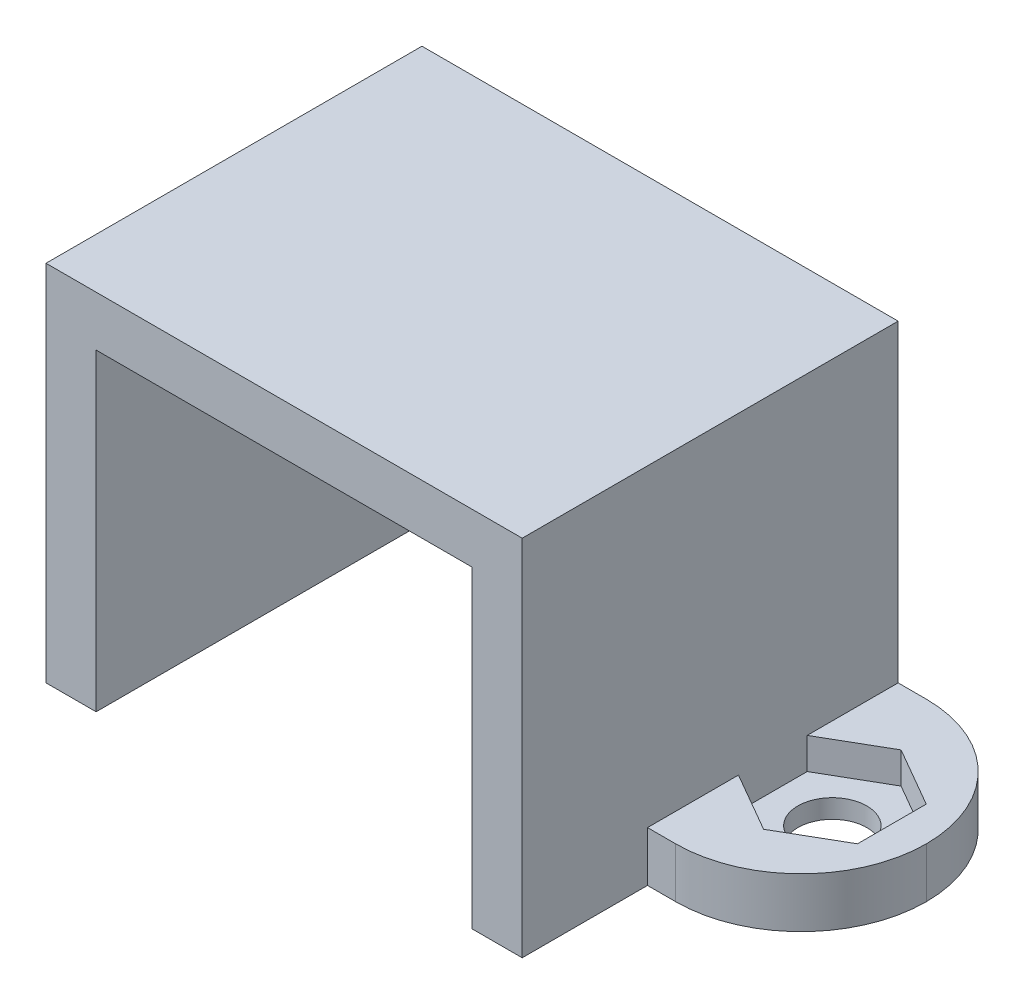
ISO-10303-21;
HEADER;
FILE_DESCRIPTION(('STEP AP214'),'2;1');
FILE_NAME('part.step','',(''),(''),'','','');
FILE_SCHEMA(('AUTOMOTIVE_DESIGN { 1 0 10303 214 1 1 1 1 }'));
ENDSEC;
DATA;
#1=APPLICATION_CONTEXT('core data for automotive mechanical design processes');
#2=APPLICATION_PROTOCOL_DEFINITION('international standard','automotive_design',2000,#1);
#3=PRODUCT_CONTEXT('',#1,'mechanical');
#4=PRODUCT('Part','Part','',(#3));
#5=PRODUCT_RELATED_PRODUCT_CATEGORY('part','',(#4));
#6=PRODUCT_DEFINITION_FORMATION('','',#4);
#7=PRODUCT_DEFINITION_CONTEXT('part definition',#1,'design');
#8=PRODUCT_DEFINITION('design','',#6,#7);
#9=PRODUCT_DEFINITION_SHAPE('','',#8);
#10=(LENGTH_UNIT() NAMED_UNIT(*) SI_UNIT(.MILLI.,.METRE.));
#11=(NAMED_UNIT(*) PLANE_ANGLE_UNIT() SI_UNIT($,.RADIAN.));
#12=(NAMED_UNIT(*) SI_UNIT($,.STERADIAN.) SOLID_ANGLE_UNIT());
#13=UNCERTAINTY_MEASURE_WITH_UNIT(LENGTH_MEASURE(1.E-05),#10,'distance_accuracy_value','');
#14=(GEOMETRIC_REPRESENTATION_CONTEXT(3) GLOBAL_UNCERTAINTY_ASSIGNED_CONTEXT((#13)) GLOBAL_UNIT_ASSIGNED_CONTEXT((#10,
#11,#12)) REPRESENTATION_CONTEXT('',''));
#15=CARTESIAN_POINT('',(0.,0.,0.));
#16=DIRECTION('',(0.,0.,1.));
#17=DIRECTION('',(1.,0.,0.));
#18=AXIS2_PLACEMENT_3D('',#15,#16,#17);
#19=CARTESIAN_POINT('',(-9.5,-18.4,4.));
#20=DIRECTION('',(0.,1.,0.));
#21=DIRECTION('',(0.,0.,1.));
#22=AXIS2_PLACEMENT_3D('',#19,#20,#21);
#23=CYLINDRICAL_SURFACE('',#22,1.1);
#24=CARTESIAN_POINT('',(-9.5,-10.,4.));
#25=DIRECTION('',(0.,1.,0.));
#26=DIRECTION('',(0.,0.,1.));
#27=AXIS2_PLACEMENT_3D('',#24,#25,#26);
#28=CIRCLE('',#27,1.1);
#29=CARTESIAN_POINT('',(-9.5,-10.,5.1));
#30=VERTEX_POINT('',#29);
#31=EDGE_CURVE('E330',#30,#30,#28,.T.);
#32=ORIENTED_EDGE('',*,*,#31,.F.);
#33=EDGE_LOOP('',(#32));
#34=FACE_BOUND('',#33,.T.);
#35=CARTESIAN_POINT('',(-9.5,-9.4,4.));
#36=DIRECTION('',(0.,1.,0.));
#37=DIRECTION('',(0.,0.,1.));
#38=AXIS2_PLACEMENT_3D('',#35,#36,#37);
#39=CIRCLE('',#38,1.1);
#40=CARTESIAN_POINT('',(-9.5,-9.4,5.1));
#41=VERTEX_POINT('',#40);
#42=EDGE_CURVE('E38',#41,#41,#39,.F.);
#43=ORIENTED_EDGE('',*,*,#42,.F.);
#44=EDGE_LOOP('',(#43));
#45=FACE_BOUND('',#44,.T.);
#46=ADVANCED_FACE('F34',(#34,#45),#23,.F.);
#47=CARTESIAN_POINT('',(9.5,-18.4,4.));
#48=DIRECTION('',(0.,1.,0.));
#49=DIRECTION('',(0.,0.,1.));
#50=AXIS2_PLACEMENT_3D('',#47,#48,#49);
#51=CYLINDRICAL_SURFACE('',#50,1.1);
#52=CARTESIAN_POINT('',(9.5,-10.,4.));
#53=DIRECTION('',(0.,1.,0.));
#54=DIRECTION('',(0.,0.,1.));
#55=AXIS2_PLACEMENT_3D('',#52,#53,#54);
#56=CIRCLE('',#55,1.1);
#57=CARTESIAN_POINT('',(9.5,-10.,5.1));
#58=VERTEX_POINT('',#57);
#59=EDGE_CURVE('E342',#58,#58,#56,.T.);
#60=ORIENTED_EDGE('',*,*,#59,.F.);
#61=EDGE_LOOP('',(#60));
#62=FACE_BOUND('',#61,.T.);
#63=CARTESIAN_POINT('',(9.5,-9.4,4.));
#64=DIRECTION('',(0.,1.,0.));
#65=DIRECTION('',(0.,0.,1.));
#66=AXIS2_PLACEMENT_3D('',#63,#64,#65);
#67=CIRCLE('',#66,1.1);
#68=CARTESIAN_POINT('',(9.5,-9.4,5.1));
#69=VERTEX_POINT('',#68);
#70=EDGE_CURVE('E269',#69,#69,#67,.F.);
#71=ORIENTED_EDGE('',*,*,#70,.F.);
#72=EDGE_LOOP('',(#71));
#73=FACE_BOUND('',#72,.T.);
#74=ADVANCED_FACE('F449',(#62,#73),#51,.F.);
#75=CARTESIAN_POINT('',(6.,-10.,12.));
#76=DIRECTION('',(0.,1.,0.));
#77=DIRECTION('',(0.,0.,1.));
#78=AXIS2_PLACEMENT_3D('',#75,#76,#77);
#79=PLANE('',#78);
#80=ORIENTED_EDGE('',*,*,#59,.T.);
#81=EDGE_LOOP('',(#80));
#82=FACE_BOUND('',#81,.T.);
#83=DIRECTION('',(1.,0.,0.));
#84=VECTOR('',#83,1.);
#85=CARTESIAN_POINT('',(6.,-10.,0.));
#86=LINE('',#85,#84);
#87=CARTESIAN_POINT('',(6.,-10.,0.));
#88=VERTEX_POINT('',#87);
#89=CARTESIAN_POINT('',(8.5,-10.,0.));
#90=VERTEX_POINT('',#89);
#91=EDGE_CURVE('E345',#88,#90,#86,.T.);
#92=ORIENTED_EDGE('',*,*,#91,.T.);
#93=CARTESIAN_POINT('',(8.5,-10.,4.));
#94=DIRECTION('',(0.,1.,0.));
#95=DIRECTION('',(0.,0.,1.));
#96=AXIS2_PLACEMENT_3D('',#93,#94,#95);
#97=CIRCLE('',#96,4.);
#98=CARTESIAN_POINT('',(12.5,-10.,4.));
#99=VERTEX_POINT('',#98);
#100=EDGE_CURVE('E433',#90,#99,#97,.F.);
#101=ORIENTED_EDGE('',*,*,#100,.T.);
#102=CARTESIAN_POINT('',(8.5,-10.,4.));
#103=DIRECTION('',(0.,1.,0.));
#104=DIRECTION('',(0.,0.,1.));
#105=AXIS2_PLACEMENT_3D('',#102,#103,#104);
#106=CIRCLE('',#105,4.);
#107=CARTESIAN_POINT('',(8.5,-10.,8.));
#108=VERTEX_POINT('',#107);
#109=EDGE_CURVE('E431',#99,#108,#106,.F.);
#110=ORIENTED_EDGE('',*,*,#109,.T.);
#111=DIRECTION('',(1.,0.,0.));
#112=VECTOR('',#111,1.);
#113=CARTESIAN_POINT('',(12.5,-10.,8.));
#114=LINE('',#113,#112);
#115=CARTESIAN_POINT('',(7.6,-10.,8.));
#116=VERTEX_POINT('',#115);
#117=EDGE_CURVE('E334',#116,#108,#114,.T.);
#118=ORIENTED_EDGE('',*,*,#117,.F.);
#119=DIRECTION('',(0.,0.,-1.));
#120=VECTOR('',#119,1.);
#121=CARTESIAN_POINT('',(7.6,-10.,12.));
#122=LINE('',#121,#120);
#123=CARTESIAN_POINT('',(7.6,-10.,12.));
#124=VERTEX_POINT('',#123);
#125=EDGE_CURVE('E335',#124,#116,#122,.T.);
#126=ORIENTED_EDGE('',*,*,#125,.F.);
#127=DIRECTION('',(1.,0.,0.));
#128=VECTOR('',#127,1.);
#129=CARTESIAN_POINT('',(6.,-10.,12.));
#130=LINE('',#129,#128);
#131=CARTESIAN_POINT('',(6.,-10.,12.));
#132=VERTEX_POINT('',#131);
#133=EDGE_CURVE('E346',#132,#124,#130,.T.);
#134=ORIENTED_EDGE('',*,*,#133,.F.);
#135=DIRECTION('',(0.,0.,-1.));
#136=VECTOR('',#135,1.);
#137=CARTESIAN_POINT('',(6.,-10.,12.));
#138=LINE('',#137,#136);
#139=EDGE_CURVE('E366',#132,#88,#138,.T.);
#140=ORIENTED_EDGE('',*,*,#139,.T.);
#141=EDGE_LOOP('',(#92,#101,#110,#118,#126,#134,#140));
#142=FACE_BOUND('',#141,.T.);
#143=ADVANCED_FACE('F455',(#82,#142),#79,.F.);
#144=CARTESIAN_POINT('',(6.,-8.4,12.));
#145=DIRECTION('',(0.,1.,0.));
#146=DIRECTION('',(0.,0.,1.));
#147=AXIS2_PLACEMENT_3D('',#144,#145,#146);
#148=PLANE('',#147);
#149=DIRECTION('',(-0.866025403784439,0.,0.5));
#150=VECTOR('',#149,1.);
#151=CARTESIAN_POINT('',(9.5,-8.4,1.80606897707942));
#152=LINE('',#151,#150);
#153=CARTESIAN_POINT('',(9.5,-8.4,1.80606897707942));
#154=VERTEX_POINT('',#153);
#155=CARTESIAN_POINT('',(7.6,-8.4,2.90303448853971));
#156=VERTEX_POINT('',#155);
#157=EDGE_CURVE('E51',#154,#156,#152,.T.);
#158=ORIENTED_EDGE('',*,*,#157,.F.);
#159=DIRECTION('',(-0.866025403784439,0.,-0.5));
#160=VECTOR('',#159,1.);
#161=CARTESIAN_POINT('',(11.4,-8.4,2.90303448853971));
#162=LINE('',#161,#160);
#163=CARTESIAN_POINT('',(11.4,-8.4,2.90303448853971));
#164=VERTEX_POINT('',#163);
#165=EDGE_CURVE('E305',#164,#154,#162,.T.);
#166=ORIENTED_EDGE('',*,*,#165,.F.);
#167=DIRECTION('',(0.,0.,-1.));
#168=VECTOR('',#167,1.);
#169=CARTESIAN_POINT('',(11.4,-8.4,5.09696551146028));
#170=LINE('',#169,#168);
#171=CARTESIAN_POINT('',(11.4,-8.4,5.09696551146028));
#172=VERTEX_POINT('',#171);
#173=EDGE_CURVE('E302',#172,#164,#170,.T.);
#174=ORIENTED_EDGE('',*,*,#173,.F.);
#175=DIRECTION('',(0.866025403784439,0.,-0.5));
#176=VECTOR('',#175,1.);
#177=CARTESIAN_POINT('',(9.5,-8.4,6.19393102292057));
#178=LINE('',#177,#176);
#179=CARTESIAN_POINT('',(9.5,-8.4,6.19393102292057));
#180=VERTEX_POINT('',#179);
#181=EDGE_CURVE('E299',#180,#172,#178,.T.);
#182=ORIENTED_EDGE('',*,*,#181,.F.);
#183=DIRECTION('',(0.866025403784438,0.,0.5));
#184=VECTOR('',#183,1.);
#185=CARTESIAN_POINT('',(7.6,-8.4,5.09696551146029));
#186=LINE('',#185,#184);
#187=CARTESIAN_POINT('',(7.6,-8.4,5.09696551146029));
#188=VERTEX_POINT('',#187);
#189=EDGE_CURVE('E296',#188,#180,#186,.T.);
#190=ORIENTED_EDGE('',*,*,#189,.F.);
#191=DIRECTION('',(0.,0.,-1.));
#192=VECTOR('',#191,1.);
#193=CARTESIAN_POINT('',(7.6,-8.4,12.));
#194=LINE('',#193,#192);
#195=CARTESIAN_POINT('',(7.6,-8.4,8.));
#196=VERTEX_POINT('',#195);
#197=EDGE_CURVE('E410',#196,#188,#194,.T.);
#198=ORIENTED_EDGE('',*,*,#197,.F.);
#199=DIRECTION('',(1.,0.,0.));
#200=VECTOR('',#199,1.);
#201=CARTESIAN_POINT('',(12.5,-8.4,8.));
#202=LINE('',#201,#200);
#203=CARTESIAN_POINT('',(8.5,-8.4,8.));
#204=VERTEX_POINT('',#203);
#205=EDGE_CURVE('E331',#196,#204,#202,.T.);
#206=ORIENTED_EDGE('',*,*,#205,.T.);
#207=CARTESIAN_POINT('',(8.5,-8.4,4.));
#208=DIRECTION('',(0.,1.,0.));
#209=DIRECTION('',(0.,0.,1.));
#210=AXIS2_PLACEMENT_3D('',#207,#208,#209);
#211=CIRCLE('',#210,4.);
#212=CARTESIAN_POINT('',(12.5,-8.4,4.));
#213=VERTEX_POINT('',#212);
#214=EDGE_CURVE('E435',#204,#213,#211,.T.);
#215=ORIENTED_EDGE('',*,*,#214,.T.);
#216=CARTESIAN_POINT('',(8.5,-8.4,4.));
#217=DIRECTION('',(0.,1.,0.));
#218=DIRECTION('',(0.,0.,1.));
#219=AXIS2_PLACEMENT_3D('',#216,#217,#218);
#220=CIRCLE('',#219,4.);
#221=CARTESIAN_POINT('',(8.5,-8.4,0.));
#222=VERTEX_POINT('',#221);
#223=EDGE_CURVE('E43',#213,#222,#220,.T.);
#224=ORIENTED_EDGE('',*,*,#223,.T.);
#225=DIRECTION('',(1.,0.,0.));
#226=VECTOR('',#225,1.);
#227=CARTESIAN_POINT('',(6.,-8.4,0.));
#228=LINE('',#227,#226);
#229=CARTESIAN_POINT('',(7.6,-8.4,0.));
#230=VERTEX_POINT('',#229);
#231=EDGE_CURVE('E369',#230,#222,#228,.T.);
#232=ORIENTED_EDGE('',*,*,#231,.F.);
#233=EDGE_CURVE('E409',#156,#230,#194,.T.);
#234=ORIENTED_EDGE('',*,*,#233,.F.);
#235=EDGE_LOOP('',(#158,#166,#174,#182,#190,#198,#206,#215,#224,#232,#234));
#236=FACE_BOUND('',#235,.T.);
#237=ADVANCED_FACE('F499',(#236),#148,.T.);
#238=CARTESIAN_POINT('',(7.6,0.,12.));
#239=DIRECTION('',(1.,0.,0.));
#240=DIRECTION('',(0.,1.,0.));
#241=AXIS2_PLACEMENT_3D('',#238,#239,#240);
#242=PLANE('',#241);
#243=DIRECTION('',(0.,-1.,0.));
#244=VECTOR('',#243,1.);
#245=CARTESIAN_POINT('',(7.6,0.,0.));
#246=LINE('',#245,#244);
#247=CARTESIAN_POINT('',(7.6,1.6,0.));
#248=VERTEX_POINT('',#247);
#249=EDGE_CURVE('E372',#248,#230,#246,.T.);
#250=ORIENTED_EDGE('',*,*,#249,.F.);
#251=DIRECTION('',(0.,0.,-1.));
#252=VECTOR('',#251,1.);
#253=CARTESIAN_POINT('',(7.6,1.6,12.));
#254=LINE('',#253,#252);
#255=CARTESIAN_POINT('',(7.6,1.6,12.));
#256=VERTEX_POINT('',#255);
#257=EDGE_CURVE('E407',#256,#248,#254,.T.);
#258=ORIENTED_EDGE('',*,*,#257,.F.);
#259=DIRECTION('',(0.,-1.,0.));
#260=VECTOR('',#259,1.);
#261=CARTESIAN_POINT('',(7.6,0.,12.));
#262=LINE('',#261,#260);
#263=EDGE_CURVE('E349',#256,#124,#262,.T.);
#264=ORIENTED_EDGE('',*,*,#263,.T.);
#265=ORIENTED_EDGE('',*,*,#125,.T.);
#266=DIRECTION('',(0.,-1.,0.));
#267=VECTOR('',#266,1.);
#268=CARTESIAN_POINT('',(7.6,-8.4,8.));
#269=LINE('',#268,#267);
#270=EDGE_CURVE('E325',#196,#116,#269,.T.);
#271=ORIENTED_EDGE('',*,*,#270,.F.);
#272=ORIENTED_EDGE('',*,*,#197,.T.);
#273=DIRECTION('',(0.,1.,0.));
#274=VECTOR('',#273,1.);
#275=CARTESIAN_POINT('',(7.6,-9.4,5.09696551146029));
#276=LINE('',#275,#274);
#277=CARTESIAN_POINT('',(7.6,-9.4,5.09696551146029));
#278=VERTEX_POINT('',#277);
#279=EDGE_CURVE('E295',#278,#188,#276,.T.);
#280=ORIENTED_EDGE('',*,*,#279,.F.);
#281=DIRECTION('',(0.,0.,1.));
#282=VECTOR('',#281,1.);
#283=CARTESIAN_POINT('',(7.6,-9.4,2.90303448853971));
#284=LINE('',#283,#282);
#285=CARTESIAN_POINT('',(7.6,-9.4,2.90303448853971));
#286=VERTEX_POINT('',#285);
#287=EDGE_CURVE('E277',#286,#278,#284,.T.);
#288=ORIENTED_EDGE('',*,*,#287,.F.);
#289=DIRECTION('',(0.,1.,0.));
#290=VECTOR('',#289,1.);
#291=CARTESIAN_POINT('',(7.6,-9.4,2.90303448853971));
#292=LINE('',#291,#290);
#293=EDGE_CURVE('E259',#286,#156,#292,.T.);
#294=ORIENTED_EDGE('',*,*,#293,.T.);
#295=ORIENTED_EDGE('',*,*,#233,.T.);
#296=EDGE_LOOP('',(#250,#258,#264,#265,#271,#272,#280,#288,#294,#295));
#297=FACE_BOUND('',#296,.T.);
#298=ADVANCED_FACE('F495',(#297),#242,.T.);
#299=CARTESIAN_POINT('',(-6.,1.6,12.));
#300=DIRECTION('',(0.,1.,0.));
#301=DIRECTION('',(0.,0.,1.));
#302=AXIS2_PLACEMENT_3D('',#299,#300,#301);
#303=PLANE('',#302);
#304=DIRECTION('',(1.,0.,0.));
#305=VECTOR('',#304,1.);
#306=CARTESIAN_POINT('',(-6.,1.6,0.));
#307=LINE('',#306,#305);
#308=CARTESIAN_POINT('',(-7.6,1.6,0.));
#309=VERTEX_POINT('',#308);
#310=EDGE_CURVE('E375',#309,#248,#307,.T.);
#311=ORIENTED_EDGE('',*,*,#310,.F.);
#312=DIRECTION('',(0.,0.,-1.));
#313=VECTOR('',#312,1.);
#314=CARTESIAN_POINT('',(-7.6,1.6,12.));
#315=LINE('',#314,#313);
#316=CARTESIAN_POINT('',(-7.6,1.6,12.));
#317=VERTEX_POINT('',#316);
#318=EDGE_CURVE('E405',#317,#309,#315,.T.);
#319=ORIENTED_EDGE('',*,*,#318,.F.);
#320=DIRECTION('',(1.,0.,0.));
#321=VECTOR('',#320,1.);
#322=CARTESIAN_POINT('',(-6.,1.6,12.));
#323=LINE('',#322,#321);
#324=EDGE_CURVE('E352',#317,#256,#323,.T.);
#325=ORIENTED_EDGE('',*,*,#324,.T.);
#326=ORIENTED_EDGE('',*,*,#257,.T.);
#327=EDGE_LOOP('',(#311,#319,#325,#326));
#328=FACE_BOUND('',#327,.T.);
#329=ADVANCED_FACE('F492',(#328),#303,.T.);
#330=CARTESIAN_POINT('',(-7.6,-10.,12.));
#331=DIRECTION('',(-1.,0.,0.));
#332=DIRECTION('',(0.,0.,1.));
#333=AXIS2_PLACEMENT_3D('',#330,#331,#332);
#334=PLANE('',#333);
#335=DIRECTION('',(0.,1.,0.));
#336=VECTOR('',#335,1.);
#337=CARTESIAN_POINT('',(-7.6,-10.,0.));
#338=LINE('',#337,#336);
#339=CARTESIAN_POINT('',(-7.6,-8.4,0.));
#340=VERTEX_POINT('',#339);
#341=EDGE_CURVE('E378',#340,#309,#338,.T.);
#342=ORIENTED_EDGE('',*,*,#341,.F.);
#343=DIRECTION('',(0.,0.,-1.));
#344=VECTOR('',#343,1.);
#345=CARTESIAN_POINT('',(-7.6,-8.4,12.));
#346=LINE('',#345,#344);
#347=CARTESIAN_POINT('',(-7.6,-8.4,2.90303448853971));
#348=VERTEX_POINT('',#347);
#349=EDGE_CURVE('E402',#348,#340,#346,.T.);
#350=ORIENTED_EDGE('',*,*,#349,.F.);
#351=DIRECTION('',(0.,1.,0.));
#352=VECTOR('',#351,1.);
#353=CARTESIAN_POINT('',(-7.6,-9.4,2.90303448853971));
#354=LINE('',#353,#352);
#355=CARTESIAN_POINT('',(-7.6,-9.4,2.90303448853971));
#356=VERTEX_POINT('',#355);
#357=EDGE_CURVE('E227',#356,#348,#354,.T.);
#358=ORIENTED_EDGE('',*,*,#357,.F.);
#359=DIRECTION('',(0.,0.,-1.));
#360=VECTOR('',#359,1.);
#361=CARTESIAN_POINT('',(-7.6,-9.4,5.09696551146029));
#362=LINE('',#361,#360);
#363=CARTESIAN_POINT('',(-7.6,-9.4,5.09696551146029));
#364=VERTEX_POINT('',#363);
#365=EDGE_CURVE('E231',#364,#356,#362,.T.);
#366=ORIENTED_EDGE('',*,*,#365,.F.);
#367=DIRECTION('',(0.,1.,0.));
#368=VECTOR('',#367,1.);
#369=CARTESIAN_POINT('',(-7.6,-9.4,5.09696551146029));
#370=LINE('',#369,#368);
#371=CARTESIAN_POINT('',(-7.6,-8.4,5.09696551146029));
#372=VERTEX_POINT('',#371);
#373=EDGE_CURVE('E218',#364,#372,#370,.T.);
#374=ORIENTED_EDGE('',*,*,#373,.T.);
#375=CARTESIAN_POINT('',(-7.6,-8.4,8.));
#376=VERTEX_POINT('',#375);
#377=EDGE_CURVE('E403',#376,#372,#346,.T.);
#378=ORIENTED_EDGE('',*,*,#377,.F.);
#379=DIRECTION('',(0.,-1.,0.));
#380=VECTOR('',#379,1.);
#381=CARTESIAN_POINT('',(-7.6,-8.4,8.));
#382=LINE('',#381,#380);
#383=CARTESIAN_POINT('',(-7.6,-10.,8.));
#384=VERTEX_POINT('',#383);
#385=EDGE_CURVE('E321',#376,#384,#382,.T.);
#386=ORIENTED_EDGE('',*,*,#385,.T.);
#387=DIRECTION('',(0.,0.,1.));
#388=VECTOR('',#387,1.);
#389=CARTESIAN_POINT('',(-7.6,-10.,12.));
#390=LINE('',#389,#388);
#391=CARTESIAN_POINT('',(-7.6,-10.,12.));
#392=VERTEX_POINT('',#391);
#393=EDGE_CURVE('E322',#384,#392,#390,.T.);
#394=ORIENTED_EDGE('',*,*,#393,.T.);
#395=DIRECTION('',(0.,1.,0.));
#396=VECTOR('',#395,1.);
#397=CARTESIAN_POINT('',(-7.6,-10.,12.));
#398=LINE('',#397,#396);
#399=EDGE_CURVE('E355',#392,#317,#398,.T.);
#400=ORIENTED_EDGE('',*,*,#399,.T.);
#401=ORIENTED_EDGE('',*,*,#318,.T.);
#402=EDGE_LOOP('',(#342,#350,#358,#366,#374,#378,#386,#394,#400,#401));
#403=FACE_BOUND('',#402,.T.);
#404=ADVANCED_FACE('F233',(#403),#334,.T.);
#405=CARTESIAN_POINT('',(-12.5,-8.4,12.));
#406=DIRECTION('',(0.,1.,0.));
#407=DIRECTION('',(0.,0.,1.));
#408=AXIS2_PLACEMENT_3D('',#405,#406,#407);
#409=PLANE('',#408);
#410=DIRECTION('',(0.866025403784438,0.,-0.500000000000001));
#411=VECTOR('',#410,1.);
#412=CARTESIAN_POINT('',(-9.5,-8.4,6.19393102292058));
#413=LINE('',#412,#411);
#414=CARTESIAN_POINT('',(-9.5,-8.4,6.19393102292058));
#415=VERTEX_POINT('',#414);
#416=EDGE_CURVE('E59',#415,#372,#413,.T.);
#417=ORIENTED_EDGE('',*,*,#416,.F.);
#418=DIRECTION('',(0.866025403784439,0.,0.5));
#419=VECTOR('',#418,1.);
#420=CARTESIAN_POINT('',(-11.4,-8.4,5.09696551146029));
#421=LINE('',#420,#419);
#422=CARTESIAN_POINT('',(-11.4,-8.4,5.09696551146029));
#423=VERTEX_POINT('',#422);
#424=EDGE_CURVE('E244',#423,#415,#421,.T.);
#425=ORIENTED_EDGE('',*,*,#424,.F.);
#426=DIRECTION('',(0.,0.,1.));
#427=VECTOR('',#426,1.);
#428=CARTESIAN_POINT('',(-11.4,-8.4,2.90303448853971));
#429=LINE('',#428,#427);
#430=CARTESIAN_POINT('',(-11.4,-8.4,2.90303448853971));
#431=VERTEX_POINT('',#430);
#432=EDGE_CURVE('E247',#431,#423,#429,.T.);
#433=ORIENTED_EDGE('',*,*,#432,.F.);
#434=DIRECTION('',(-0.866025403784439,0.,0.5));
#435=VECTOR('',#434,1.);
#436=CARTESIAN_POINT('',(-9.5,-8.4,1.80606897707942));
#437=LINE('',#436,#435);
#438=CARTESIAN_POINT('',(-9.5,-8.4,1.80606897707942));
#439=VERTEX_POINT('',#438);
#440=EDGE_CURVE('E262',#439,#431,#437,.T.);
#441=ORIENTED_EDGE('',*,*,#440,.F.);
#442=DIRECTION('',(-0.866025403784439,0.,-0.5));
#443=VECTOR('',#442,1.);
#444=CARTESIAN_POINT('',(-7.6,-8.4,2.90303448853971));
#445=LINE('',#444,#443);
#446=EDGE_CURVE('E258',#348,#439,#445,.T.);
#447=ORIENTED_EDGE('',*,*,#446,.F.);
#448=ORIENTED_EDGE('',*,*,#349,.T.);
#449=DIRECTION('',(1.,0.,0.));
#450=VECTOR('',#449,1.);
#451=CARTESIAN_POINT('',(-12.5,-8.4,0.));
#452=LINE('',#451,#450);
#453=CARTESIAN_POINT('',(-8.5,-8.4,0.));
#454=VERTEX_POINT('',#453);
#455=EDGE_CURVE('E381',#454,#340,#452,.T.);
#456=ORIENTED_EDGE('',*,*,#455,.F.);
#457=CARTESIAN_POINT('',(-8.5,-8.4,4.));
#458=DIRECTION('',(0.,1.,0.));
#459=DIRECTION('',(0.,0.,1.));
#460=AXIS2_PLACEMENT_3D('',#457,#458,#459);
#461=CIRCLE('',#460,4.);
#462=CARTESIAN_POINT('',(-12.5,-8.4,4.));
#463=VERTEX_POINT('',#462);
#464=EDGE_CURVE('E423',#454,#463,#461,.T.);
#465=ORIENTED_EDGE('',*,*,#464,.T.);
#466=CARTESIAN_POINT('',(-8.5,-8.4,4.));
#467=DIRECTION('',(0.,1.,0.));
#468=DIRECTION('',(0.,0.,1.));
#469=AXIS2_PLACEMENT_3D('',#466,#467,#468);
#470=CIRCLE('',#469,4.);
#471=CARTESIAN_POINT('',(-8.5,-8.4,8.));
#472=VERTEX_POINT('',#471);
#473=EDGE_CURVE('E421',#463,#472,#470,.T.);
#474=ORIENTED_EDGE('',*,*,#473,.T.);
#475=DIRECTION('',(1.,0.,0.));
#476=VECTOR('',#475,1.);
#477=CARTESIAN_POINT('',(-12.5,-8.4,8.));
#478=LINE('',#477,#476);
#479=EDGE_CURVE('E319',#472,#376,#478,.T.);
#480=ORIENTED_EDGE('',*,*,#479,.T.);
#481=ORIENTED_EDGE('',*,*,#377,.T.);
#482=EDGE_LOOP('',(#417,#425,#433,#441,#447,#448,#456,#465,#474,#480,#481));
#483=FACE_BOUND('',#482,.T.);
#484=ADVANCED_FACE('F485',(#483),#409,.T.);
#485=CARTESIAN_POINT('',(-12.5,-10.,12.));
#486=DIRECTION('',(0.,1.,0.));
#487=DIRECTION('',(0.,0.,1.));
#488=AXIS2_PLACEMENT_3D('',#485,#486,#487);
#489=PLANE('',#488);
#490=ORIENTED_EDGE('',*,*,#31,.T.);
#491=EDGE_LOOP('',(#490));
#492=FACE_BOUND('',#491,.T.);
#493=CARTESIAN_POINT('',(-8.5,-10.,4.));
#494=DIRECTION('',(0.,1.,0.));
#495=DIRECTION('',(0.,0.,1.));
#496=AXIS2_PLACEMENT_3D('',#493,#494,#495);
#497=CIRCLE('',#496,4.);
#498=CARTESIAN_POINT('',(-8.5,-10.,8.));
#499=VERTEX_POINT('',#498);
#500=CARTESIAN_POINT('',(-12.5,-10.,4.));
#501=VERTEX_POINT('',#500);
#502=EDGE_CURVE('E425',#499,#501,#497,.F.);
#503=ORIENTED_EDGE('',*,*,#502,.T.);
#504=CARTESIAN_POINT('',(-8.5,-10.,4.));
#505=DIRECTION('',(0.,1.,0.));
#506=DIRECTION('',(0.,0.,1.));
#507=AXIS2_PLACEMENT_3D('',#504,#505,#506);
#508=CIRCLE('',#507,4.);
#509=CARTESIAN_POINT('',(-8.5,-10.,0.));
#510=VERTEX_POINT('',#509);
#511=EDGE_CURVE('E427',#501,#510,#508,.F.);
#512=ORIENTED_EDGE('',*,*,#511,.T.);
#513=DIRECTION('',(1.,0.,0.));
#514=VECTOR('',#513,1.);
#515=CARTESIAN_POINT('',(-12.5,-10.,0.));
#516=LINE('',#515,#514);
#517=CARTESIAN_POINT('',(-6.,-10.,0.));
#518=VERTEX_POINT('',#517);
#519=EDGE_CURVE('E384',#510,#518,#516,.T.);
#520=ORIENTED_EDGE('',*,*,#519,.T.);
#521=DIRECTION('',(0.,0.,-1.));
#522=VECTOR('',#521,1.);
#523=CARTESIAN_POINT('',(-6.,-10.,12.));
#524=LINE('',#523,#522);
#525=CARTESIAN_POINT('',(-6.,-10.,12.));
#526=VERTEX_POINT('',#525);
#527=EDGE_CURVE('E399',#526,#518,#524,.T.);
#528=ORIENTED_EDGE('',*,*,#527,.F.);
#529=DIRECTION('',(1.,0.,0.));
#530=VECTOR('',#529,1.);
#531=CARTESIAN_POINT('',(-12.5,-10.,12.));
#532=LINE('',#531,#530);
#533=EDGE_CURVE('E358',#392,#526,#532,.T.);
#534=ORIENTED_EDGE('',*,*,#533,.F.);
#535=ORIENTED_EDGE('',*,*,#393,.F.);
#536=DIRECTION('',(1.,0.,0.));
#537=VECTOR('',#536,1.);
#538=CARTESIAN_POINT('',(-12.5,-10.,8.));
#539=LINE('',#538,#537);
#540=EDGE_CURVE('E323',#499,#384,#539,.T.);
#541=ORIENTED_EDGE('',*,*,#540,.F.);
#542=EDGE_LOOP('',(#503,#512,#520,#528,#534,#535,#541));
#543=FACE_BOUND('',#542,.T.);
#544=ADVANCED_FACE('F481',(#492,#543),#489,.F.);
#545=CARTESIAN_POINT('',(-6.,-10.,12.));
#546=DIRECTION('',(-1.,0.,0.));
#547=DIRECTION('',(0.,0.,1.));
#548=AXIS2_PLACEMENT_3D('',#545,#546,#547);
#549=PLANE('',#548);
#550=DIRECTION('',(0.,1.,0.));
#551=VECTOR('',#550,1.);
#552=CARTESIAN_POINT('',(-6.,-10.,0.));
#553=LINE('',#552,#551);
#554=CARTESIAN_POINT('',(-6.,0.,0.));
#555=VERTEX_POINT('',#554);
#556=EDGE_CURVE('E386',#518,#555,#553,.T.);
#557=ORIENTED_EDGE('',*,*,#556,.T.);
#558=DIRECTION('',(0.,0.,-1.));
#559=VECTOR('',#558,1.);
#560=CARTESIAN_POINT('',(-6.,0.,12.));
#561=LINE('',#560,#559);
#562=CARTESIAN_POINT('',(-6.,0.,12.));
#563=VERTEX_POINT('',#562);
#564=EDGE_CURVE('E396',#563,#555,#561,.T.);
#565=ORIENTED_EDGE('',*,*,#564,.F.);
#566=DIRECTION('',(0.,1.,0.));
#567=VECTOR('',#566,1.);
#568=CARTESIAN_POINT('',(-6.,-10.,12.));
#569=LINE('',#568,#567);
#570=EDGE_CURVE('E360',#526,#563,#569,.T.);
#571=ORIENTED_EDGE('',*,*,#570,.F.);
#572=ORIENTED_EDGE('',*,*,#527,.T.);
#573=EDGE_LOOP('',(#557,#565,#571,#572));
#574=FACE_BOUND('',#573,.T.);
#575=ADVANCED_FACE('F477',(#574),#549,.F.);
#576=CARTESIAN_POINT('',(-6.,0.,12.));
#577=DIRECTION('',(0.,1.,0.));
#578=DIRECTION('',(0.,0.,1.));
#579=AXIS2_PLACEMENT_3D('',#576,#577,#578);
#580=PLANE('',#579);
#581=DIRECTION('',(1.,0.,0.));
#582=VECTOR('',#581,1.);
#583=CARTESIAN_POINT('',(-6.,0.,0.));
#584=LINE('',#583,#582);
#585=CARTESIAN_POINT('',(6.,0.,0.));
#586=VERTEX_POINT('',#585);
#587=EDGE_CURVE('E388',#555,#586,#584,.T.);
#588=ORIENTED_EDGE('',*,*,#587,.T.);
#589=DIRECTION('',(0.,0.,-1.));
#590=VECTOR('',#589,1.);
#591=CARTESIAN_POINT('',(6.,0.,12.));
#592=LINE('',#591,#590);
#593=CARTESIAN_POINT('',(6.,0.,12.));
#594=VERTEX_POINT('',#593);
#595=EDGE_CURVE('E393',#594,#586,#592,.T.);
#596=ORIENTED_EDGE('',*,*,#595,.F.);
#597=DIRECTION('',(1.,0.,0.));
#598=VECTOR('',#597,1.);
#599=CARTESIAN_POINT('',(-6.,0.,12.));
#600=LINE('',#599,#598);
#601=EDGE_CURVE('E362',#563,#594,#600,.T.);
#602=ORIENTED_EDGE('',*,*,#601,.F.);
#603=ORIENTED_EDGE('',*,*,#564,.T.);
#604=EDGE_LOOP('',(#588,#596,#602,#603));
#605=FACE_BOUND('',#604,.T.);
#606=ADVANCED_FACE('F473',(#605),#580,.F.);
#607=CARTESIAN_POINT('',(6.,0.,12.));
#608=DIRECTION('',(1.,0.,0.));
#609=DIRECTION('',(0.,1.,0.));
#610=AXIS2_PLACEMENT_3D('',#607,#608,#609);
#611=PLANE('',#610);
#612=DIRECTION('',(0.,-1.,0.));
#613=VECTOR('',#612,1.);
#614=CARTESIAN_POINT('',(6.,0.,0.));
#615=LINE('',#614,#613);
#616=EDGE_CURVE('E350',#586,#88,#615,.T.);
#617=ORIENTED_EDGE('',*,*,#616,.T.);
#618=ORIENTED_EDGE('',*,*,#139,.F.);
#619=DIRECTION('',(0.,-1.,0.));
#620=VECTOR('',#619,1.);
#621=CARTESIAN_POINT('',(6.,0.,12.));
#622=LINE('',#621,#620);
#623=EDGE_CURVE('E364',#594,#132,#622,.T.);
#624=ORIENTED_EDGE('',*,*,#623,.F.);
#625=ORIENTED_EDGE('',*,*,#595,.T.);
#626=EDGE_LOOP('',(#617,#618,#624,#625));
#627=FACE_BOUND('',#626,.T.);
#628=ADVANCED_FACE('F465',(#627),#611,.F.);
#629=CARTESIAN_POINT('',(0.,0.,12.));
#630=DIRECTION('',(0.,0.,-1.));
#631=DIRECTION('',(-1.,0.,0.));
#632=AXIS2_PLACEMENT_3D('',#629,#630,#631);
#633=PLANE('',#632);
#634=ORIENTED_EDGE('',*,*,#399,.F.);
#635=ORIENTED_EDGE('',*,*,#533,.T.);
#636=ORIENTED_EDGE('',*,*,#570,.T.);
#637=ORIENTED_EDGE('',*,*,#601,.T.);
#638=ORIENTED_EDGE('',*,*,#623,.T.);
#639=ORIENTED_EDGE('',*,*,#133,.T.);
#640=ORIENTED_EDGE('',*,*,#263,.F.);
#641=ORIENTED_EDGE('',*,*,#324,.F.);
#642=EDGE_LOOP('',(#634,#635,#636,#637,#638,#639,#640,#641));
#643=FACE_BOUND('',#642,.T.);
#644=ADVANCED_FACE('F461',(#643),#633,.F.);
#645=CARTESIAN_POINT('',(0.,0.,0.));
#646=DIRECTION('',(0.,0.,-1.));
#647=DIRECTION('',(-1.,0.,0.));
#648=AXIS2_PLACEMENT_3D('',#645,#646,#647);
#649=PLANE('',#648);
#650=ORIENTED_EDGE('',*,*,#519,.F.);
#651=DIRECTION('',(0.,1.,0.));
#652=VECTOR('',#651,1.);
#653=CARTESIAN_POINT('',(-8.5,0.,0.));
#654=LINE('',#653,#652);
#655=EDGE_CURVE('E418',#510,#454,#654,.T.);
#656=ORIENTED_EDGE('',*,*,#655,.T.);
#657=ORIENTED_EDGE('',*,*,#455,.T.);
#658=ORIENTED_EDGE('',*,*,#341,.T.);
#659=ORIENTED_EDGE('',*,*,#310,.T.);
#660=ORIENTED_EDGE('',*,*,#249,.T.);
#661=ORIENTED_EDGE('',*,*,#231,.T.);
#662=DIRECTION('',(0.,-1.,0.));
#663=VECTOR('',#662,1.);
#664=CARTESIAN_POINT('',(8.5,0.,0.));
#665=LINE('',#664,#663);
#666=EDGE_CURVE('E413',#222,#90,#665,.T.);
#667=ORIENTED_EDGE('',*,*,#666,.T.);
#668=ORIENTED_EDGE('',*,*,#91,.F.);
#669=ORIENTED_EDGE('',*,*,#616,.F.);
#670=ORIENTED_EDGE('',*,*,#587,.F.);
#671=ORIENTED_EDGE('',*,*,#556,.F.);
#672=EDGE_LOOP('',(#650,#656,#657,#658,#659,#660,#661,#667,#668,#669,#670,#671));
#673=FACE_BOUND('',#672,.T.);
#674=ADVANCED_FACE('F464',(#673),#649,.T.);
#675=CARTESIAN_POINT('',(12.5,-8.4,8.));
#676=DIRECTION('',(0.,0.,-1.));
#677=DIRECTION('',(-1.,0.,0.));
#678=AXIS2_PLACEMENT_3D('',#675,#676,#677);
#679=PLANE('',#678);
#680=ORIENTED_EDGE('',*,*,#117,.T.);
#681=DIRECTION('',(0.,-1.,0.));
#682=VECTOR('',#681,1.);
#683=CARTESIAN_POINT('',(8.5,-8.4,8.));
#684=LINE('',#683,#682);
#685=EDGE_CURVE('E11',#108,#204,#684,.F.);
#686=ORIENTED_EDGE('',*,*,#685,.T.);
#687=ORIENTED_EDGE('',*,*,#205,.F.);
#688=ORIENTED_EDGE('',*,*,#270,.T.);
#689=EDGE_LOOP('',(#680,#686,#687,#688));
#690=FACE_BOUND('',#689,.T.);
#691=ADVANCED_FACE('F469',(#690),#679,.F.);
#692=CARTESIAN_POINT('',(-12.5,-8.4,8.));
#693=DIRECTION('',(0.,0.,-1.));
#694=DIRECTION('',(-1.,0.,0.));
#695=AXIS2_PLACEMENT_3D('',#692,#693,#694);
#696=PLANE('',#695);
#697=ORIENTED_EDGE('',*,*,#479,.F.);
#698=DIRECTION('',(0.,-1.,0.));
#699=VECTOR('',#698,1.);
#700=CARTESIAN_POINT('',(-8.5,-10.,8.));
#701=LINE('',#700,#699);
#702=EDGE_CURVE('E429',#472,#499,#701,.T.);
#703=ORIENTED_EDGE('',*,*,#702,.T.);
#704=ORIENTED_EDGE('',*,*,#540,.T.);
#705=ORIENTED_EDGE('',*,*,#385,.F.);
#706=EDGE_LOOP('',(#697,#703,#704,#705));
#707=FACE_BOUND('',#706,.T.);
#708=ADVANCED_FACE('F513',(#707),#696,.F.);
#709=CARTESIAN_POINT('',(-8.5,-8.4,4.));
#710=DIRECTION('',(0.,1.,0.));
#711=DIRECTION('',(0.,0.,1.));
#712=AXIS2_PLACEMENT_3D('',#709,#710,#711);
#713=CYLINDRICAL_SURFACE('',#712,4.);
#714=DIRECTION('',(0.,-1.,0.));
#715=VECTOR('',#714,1.);
#716=CARTESIAN_POINT('',(-12.5,-8.4,4.));
#717=LINE('',#716,#715);
#718=EDGE_CURVE('E338',#501,#463,#717,.F.);
#719=ORIENTED_EDGE('',*,*,#718,.F.);
#720=ORIENTED_EDGE('',*,*,#502,.F.);
#721=ORIENTED_EDGE('',*,*,#702,.F.);
#722=ORIENTED_EDGE('',*,*,#473,.F.);
#723=EDGE_LOOP('',(#719,#720,#721,#722));
#724=FACE_BOUND('',#723,.T.);
#725=ADVANCED_FACE('F510',(#724),#713,.T.);
#726=CARTESIAN_POINT('',(-8.5,0.,4.));
#727=DIRECTION('',(0.,1.,0.));
#728=DIRECTION('',(0.,0.,1.));
#729=AXIS2_PLACEMENT_3D('',#726,#727,#728);
#730=CYLINDRICAL_SURFACE('',#729,4.);
#731=ORIENTED_EDGE('',*,*,#511,.F.);
#732=ORIENTED_EDGE('',*,*,#718,.T.);
#733=ORIENTED_EDGE('',*,*,#464,.F.);
#734=ORIENTED_EDGE('',*,*,#655,.F.);
#735=EDGE_LOOP('',(#731,#732,#733,#734));
#736=FACE_BOUND('',#735,.T.);
#737=ADVANCED_FACE('F507',(#736),#730,.T.);
#738=CARTESIAN_POINT('',(8.5,-8.4,4.));
#739=DIRECTION('',(0.,1.,0.));
#740=DIRECTION('',(0.,0.,1.));
#741=AXIS2_PLACEMENT_3D('',#738,#739,#740);
#742=CYLINDRICAL_SURFACE('',#741,4.);
#743=DIRECTION('',(0.,-1.,0.));
#744=VECTOR('',#743,1.);
#745=CARTESIAN_POINT('',(12.5,-10.,4.));
#746=LINE('',#745,#744);
#747=EDGE_CURVE('E440',#213,#99,#746,.T.);
#748=ORIENTED_EDGE('',*,*,#747,.F.);
#749=ORIENTED_EDGE('',*,*,#214,.F.);
#750=ORIENTED_EDGE('',*,*,#685,.F.);
#751=ORIENTED_EDGE('',*,*,#109,.F.);
#752=EDGE_LOOP('',(#748,#749,#750,#751));
#753=FACE_BOUND('',#752,.T.);
#754=ADVANCED_FACE('F36',(#753),#742,.T.);
#755=CARTESIAN_POINT('',(8.5,0.,4.));
#756=DIRECTION('',(0.,-1.,0.));
#757=DIRECTION('',(0.,0.,-1.));
#758=AXIS2_PLACEMENT_3D('',#755,#756,#757);
#759=CYLINDRICAL_SURFACE('',#758,4.);
#760=ORIENTED_EDGE('',*,*,#223,.F.);
#761=ORIENTED_EDGE('',*,*,#747,.T.);
#762=ORIENTED_EDGE('',*,*,#100,.F.);
#763=ORIENTED_EDGE('',*,*,#666,.F.);
#764=EDGE_LOOP('',(#760,#761,#762,#763));
#765=FACE_BOUND('',#764,.T.);
#766=ADVANCED_FACE('F515',(#765),#759,.T.);
#767=CARTESIAN_POINT('',(0.,-9.4,0.));
#768=DIRECTION('',(0.,1.,0.));
#769=DIRECTION('',(0.,0.,1.));
#770=AXIS2_PLACEMENT_3D('',#767,#768,#769);
#771=PLANE('',#770);
#772=ORIENTED_EDGE('',*,*,#287,.T.);
#773=DIRECTION('',(0.866025403784438,0.,0.5));
#774=VECTOR('',#773,1.);
#775=CARTESIAN_POINT('',(7.6,-9.4,5.09696551146029));
#776=LINE('',#775,#774);
#777=CARTESIAN_POINT('',(9.5,-9.4,6.19393102292057));
#778=VERTEX_POINT('',#777);
#779=EDGE_CURVE('E280',#278,#778,#776,.T.);
#780=ORIENTED_EDGE('',*,*,#779,.T.);
#781=DIRECTION('',(0.866025403784439,0.,-0.5));
#782=VECTOR('',#781,1.);
#783=CARTESIAN_POINT('',(9.5,-9.4,6.19393102292057));
#784=LINE('',#783,#782);
#785=CARTESIAN_POINT('',(11.4,-9.4,5.09696551146028));
#786=VERTEX_POINT('',#785);
#787=EDGE_CURVE('E283',#778,#786,#784,.T.);
#788=ORIENTED_EDGE('',*,*,#787,.T.);
#789=DIRECTION('',(0.,0.,-1.));
#790=VECTOR('',#789,1.);
#791=CARTESIAN_POINT('',(11.4,-9.4,5.09696551146028));
#792=LINE('',#791,#790);
#793=CARTESIAN_POINT('',(11.4,-9.4,2.90303448853971));
#794=VERTEX_POINT('',#793);
#795=EDGE_CURVE('E286',#786,#794,#792,.T.);
#796=ORIENTED_EDGE('',*,*,#795,.T.);
#797=DIRECTION('',(-0.866025403784439,0.,-0.5));
#798=VECTOR('',#797,1.);
#799=CARTESIAN_POINT('',(11.4,-9.4,2.90303448853971));
#800=LINE('',#799,#798);
#801=CARTESIAN_POINT('',(9.5,-9.4,1.80606897707942));
#802=VERTEX_POINT('',#801);
#803=EDGE_CURVE('E289',#794,#802,#800,.T.);
#804=ORIENTED_EDGE('',*,*,#803,.T.);
#805=DIRECTION('',(-0.866025403784439,0.,0.5));
#806=VECTOR('',#805,1.);
#807=CARTESIAN_POINT('',(9.5,-9.4,1.80606897707942));
#808=LINE('',#807,#806);
#809=EDGE_CURVE('E292',#802,#286,#808,.T.);
#810=ORIENTED_EDGE('',*,*,#809,.T.);
#811=EDGE_LOOP('',(#772,#780,#788,#796,#804,#810));
#812=FACE_BOUND('',#811,.T.);
#813=ORIENTED_EDGE('',*,*,#70,.T.);
#814=EDGE_LOOP('',(#813));
#815=FACE_BOUND('',#814,.T.);
#816=ADVANCED_FACE('F517',(#812,#815),#771,.T.);
#817=CARTESIAN_POINT('',(9.5,-9.4,1.80606897707942));
#818=DIRECTION('',(-0.5,0.,-0.866025403784439));
#819=DIRECTION('',(-0.866025403784439,0.,0.5));
#820=AXIS2_PLACEMENT_3D('',#817,#818,#819);
#821=PLANE('',#820);
#822=ORIENTED_EDGE('',*,*,#157,.T.);
#823=ORIENTED_EDGE('',*,*,#293,.F.);
#824=ORIENTED_EDGE('',*,*,#809,.F.);
#825=DIRECTION('',(0.,1.,0.));
#826=VECTOR('',#825,1.);
#827=CARTESIAN_POINT('',(9.5,-9.4,1.80606897707942));
#828=LINE('',#827,#826);
#829=EDGE_CURVE('E310',#802,#154,#828,.T.);
#830=ORIENTED_EDGE('',*,*,#829,.T.);
#831=EDGE_LOOP('',(#822,#823,#824,#830));
#832=FACE_BOUND('',#831,.T.);
#833=ADVANCED_FACE('F523',(#832),#821,.F.);
#834=CARTESIAN_POINT('',(11.4,-9.4,2.90303448853971));
#835=DIRECTION('',(0.5,0.,-0.866025403784439));
#836=DIRECTION('',(-0.866025403784439,0.,-0.5));
#837=AXIS2_PLACEMENT_3D('',#834,#835,#836);
#838=PLANE('',#837);
#839=ORIENTED_EDGE('',*,*,#165,.T.);
#840=ORIENTED_EDGE('',*,*,#829,.F.);
#841=ORIENTED_EDGE('',*,*,#803,.F.);
#842=DIRECTION('',(0.,1.,0.));
#843=VECTOR('',#842,1.);
#844=CARTESIAN_POINT('',(11.4,-9.4,2.90303448853971));
#845=LINE('',#844,#843);
#846=EDGE_CURVE('E312',#794,#164,#845,.T.);
#847=ORIENTED_EDGE('',*,*,#846,.T.);
#848=EDGE_LOOP('',(#839,#840,#841,#847));
#849=FACE_BOUND('',#848,.T.);
#850=ADVANCED_FACE('F543',(#849),#838,.F.);
#851=CARTESIAN_POINT('',(11.4,-9.4,5.09696551146028));
#852=DIRECTION('',(1.,0.,0.));
#853=DIRECTION('',(0.,0.,-1.));
#854=AXIS2_PLACEMENT_3D('',#851,#852,#853);
#855=PLANE('',#854);
#856=ORIENTED_EDGE('',*,*,#173,.T.);
#857=ORIENTED_EDGE('',*,*,#846,.F.);
#858=ORIENTED_EDGE('',*,*,#795,.F.);
#859=DIRECTION('',(0.,1.,0.));
#860=VECTOR('',#859,1.);
#861=CARTESIAN_POINT('',(11.4,-9.4,5.09696551146028));
#862=LINE('',#861,#860);
#863=EDGE_CURVE('E314',#786,#172,#862,.T.);
#864=ORIENTED_EDGE('',*,*,#863,.T.);
#865=EDGE_LOOP('',(#856,#857,#858,#864));
#866=FACE_BOUND('',#865,.T.);
#867=ADVANCED_FACE('F547',(#866),#855,.F.);
#868=CARTESIAN_POINT('',(9.5,-9.4,6.19393102292057));
#869=DIRECTION('',(0.5,0.,0.866025403784439));
#870=DIRECTION('',(0.866025403784439,0.,-0.5));
#871=AXIS2_PLACEMENT_3D('',#868,#869,#870);
#872=PLANE('',#871);
#873=ORIENTED_EDGE('',*,*,#181,.T.);
#874=ORIENTED_EDGE('',*,*,#863,.F.);
#875=ORIENTED_EDGE('',*,*,#787,.F.);
#876=DIRECTION('',(0.,1.,0.));
#877=VECTOR('',#876,1.);
#878=CARTESIAN_POINT('',(9.5,-9.4,6.19393102292057));
#879=LINE('',#878,#877);
#880=EDGE_CURVE('E316',#778,#180,#879,.T.);
#881=ORIENTED_EDGE('',*,*,#880,.T.);
#882=EDGE_LOOP('',(#873,#874,#875,#881));
#883=FACE_BOUND('',#882,.T.);
#884=ADVANCED_FACE('F550',(#883),#872,.F.);
#885=CARTESIAN_POINT('',(7.6,-9.4,5.09696551146029));
#886=DIRECTION('',(-0.5,0.,0.866025403784438));
#887=DIRECTION('',(0.866025403784439,0.,0.5));
#888=AXIS2_PLACEMENT_3D('',#885,#886,#887);
#889=PLANE('',#888);
#890=ORIENTED_EDGE('',*,*,#189,.T.);
#891=ORIENTED_EDGE('',*,*,#880,.F.);
#892=ORIENTED_EDGE('',*,*,#779,.F.);
#893=ORIENTED_EDGE('',*,*,#279,.T.);
#894=EDGE_LOOP('',(#890,#891,#892,#893));
#895=FACE_BOUND('',#894,.T.);
#896=ADVANCED_FACE('F620',(#895),#889,.F.);
#897=CARTESIAN_POINT('',(0.,-9.4,0.));
#898=DIRECTION('',(0.,1.,0.));
#899=DIRECTION('',(0.,0.,1.));
#900=AXIS2_PLACEMENT_3D('',#897,#898,#899);
#901=PLANE('',#900);
#902=DIRECTION('',(0.866025403784438,0.,-0.500000000000001));
#903=VECTOR('',#902,1.);
#904=CARTESIAN_POINT('',(-9.5,-9.4,6.19393102292058));
#905=LINE('',#904,#903);
#906=CARTESIAN_POINT('',(-9.5,-9.4,6.19393102292058));
#907=VERTEX_POINT('',#906);
#908=EDGE_CURVE('E222',#907,#364,#905,.T.);
#909=ORIENTED_EDGE('',*,*,#908,.T.);
#910=ORIENTED_EDGE('',*,*,#365,.T.);
#911=DIRECTION('',(-0.866025403784439,0.,-0.5));
#912=VECTOR('',#911,1.);
#913=CARTESIAN_POINT('',(-7.6,-9.4,2.90303448853971));
#914=LINE('',#913,#912);
#915=CARTESIAN_POINT('',(-9.5,-9.4,1.80606897707942));
#916=VERTEX_POINT('',#915);
#917=EDGE_CURVE('E238',#356,#916,#914,.T.);
#918=ORIENTED_EDGE('',*,*,#917,.T.);
#919=DIRECTION('',(-0.866025403784439,0.,0.5));
#920=VECTOR('',#919,1.);
#921=CARTESIAN_POINT('',(-9.5,-9.4,1.80606897707942));
#922=LINE('',#921,#920);
#923=CARTESIAN_POINT('',(-11.4,-9.4,2.90303448853971));
#924=VERTEX_POINT('',#923);
#925=EDGE_CURVE('E251',#916,#924,#922,.T.);
#926=ORIENTED_EDGE('',*,*,#925,.T.);
#927=DIRECTION('',(0.,0.,1.));
#928=VECTOR('',#927,1.);
#929=CARTESIAN_POINT('',(-11.4,-9.4,2.90303448853971));
#930=LINE('',#929,#928);
#931=CARTESIAN_POINT('',(-11.4,-9.4,5.09696551146029));
#932=VERTEX_POINT('',#931);
#933=EDGE_CURVE('E254',#924,#932,#930,.T.);
#934=ORIENTED_EDGE('',*,*,#933,.T.);
#935=DIRECTION('',(0.866025403784439,0.,0.5));
#936=VECTOR('',#935,1.);
#937=CARTESIAN_POINT('',(-11.4,-9.4,5.09696551146029));
#938=LINE('',#937,#936);
#939=EDGE_CURVE('E228',#932,#907,#938,.T.);
#940=ORIENTED_EDGE('',*,*,#939,.T.);
#941=EDGE_LOOP('',(#909,#910,#918,#926,#934,#940));
#942=FACE_BOUND('',#941,.T.);
#943=ORIENTED_EDGE('',*,*,#42,.T.);
#944=EDGE_LOOP('',(#943));
#945=FACE_BOUND('',#944,.T.);
#946=ADVANCED_FACE('F240',(#942,#945),#901,.T.);
#947=CARTESIAN_POINT('',(-9.5,-9.4,6.19393102292058));
#948=DIRECTION('',(0.500000000000001,0.,0.866025403784438));
#949=DIRECTION('',(0.866025403784438,0.,-0.500000000000001));
#950=AXIS2_PLACEMENT_3D('',#947,#948,#949);
#951=PLANE('',#950);
#952=ORIENTED_EDGE('',*,*,#416,.T.);
#953=ORIENTED_EDGE('',*,*,#373,.F.);
#954=ORIENTED_EDGE('',*,*,#908,.F.);
#955=DIRECTION('',(0.,1.,0.));
#956=VECTOR('',#955,1.);
#957=CARTESIAN_POINT('',(-9.5,-9.4,6.19393102292058));
#958=LINE('',#957,#956);
#959=EDGE_CURVE('E267',#907,#415,#958,.T.);
#960=ORIENTED_EDGE('',*,*,#959,.T.);
#961=EDGE_LOOP('',(#952,#953,#954,#960));
#962=FACE_BOUND('',#961,.T.);
#963=ADVANCED_FACE('F220',(#962),#951,.F.);
#964=CARTESIAN_POINT('',(-11.4,-9.4,5.09696551146029));
#965=DIRECTION('',(-0.5,0.,0.866025403784439));
#966=DIRECTION('',(0.866025403784439,0.,0.5));
#967=AXIS2_PLACEMENT_3D('',#964,#965,#966);
#968=PLANE('',#967);
#969=ORIENTED_EDGE('',*,*,#424,.T.);
#970=ORIENTED_EDGE('',*,*,#959,.F.);
#971=ORIENTED_EDGE('',*,*,#939,.F.);
#972=DIRECTION('',(0.,1.,0.));
#973=VECTOR('',#972,1.);
#974=CARTESIAN_POINT('',(-11.4,-9.4,5.09696551146029));
#975=LINE('',#974,#973);
#976=EDGE_CURVE('E270',#932,#423,#975,.T.);
#977=ORIENTED_EDGE('',*,*,#976,.T.);
#978=EDGE_LOOP('',(#969,#970,#971,#977));
#979=FACE_BOUND('',#978,.T.);
#980=ADVANCED_FACE('F591',(#979),#968,.F.);
#981=CARTESIAN_POINT('',(-11.4,-9.4,2.90303448853971));
#982=DIRECTION('',(-1.,0.,0.));
#983=DIRECTION('',(0.,0.,1.));
#984=AXIS2_PLACEMENT_3D('',#981,#982,#983);
#985=PLANE('',#984);
#986=ORIENTED_EDGE('',*,*,#432,.T.);
#987=ORIENTED_EDGE('',*,*,#976,.F.);
#988=ORIENTED_EDGE('',*,*,#933,.F.);
#989=DIRECTION('',(0.,1.,0.));
#990=VECTOR('',#989,1.);
#991=CARTESIAN_POINT('',(-11.4,-9.4,2.90303448853971));
#992=LINE('',#991,#990);
#993=EDGE_CURVE('E272',#924,#431,#992,.T.);
#994=ORIENTED_EDGE('',*,*,#993,.T.);
#995=EDGE_LOOP('',(#986,#987,#988,#994));
#996=FACE_BOUND('',#995,.T.);
#997=ADVANCED_FACE('F594',(#996),#985,.F.);
#998=CARTESIAN_POINT('',(-9.5,-9.4,1.80606897707942));
#999=DIRECTION('',(-0.5,0.,-0.866025403784439));
#1000=DIRECTION('',(-0.866025403784439,0.,0.5));
#1001=AXIS2_PLACEMENT_3D('',#998,#999,#1000);
#1002=PLANE('',#1001);
#1003=ORIENTED_EDGE('',*,*,#440,.T.);
#1004=ORIENTED_EDGE('',*,*,#993,.F.);
#1005=ORIENTED_EDGE('',*,*,#925,.F.);
#1006=DIRECTION('',(0.,1.,0.));
#1007=VECTOR('',#1006,1.);
#1008=CARTESIAN_POINT('',(-9.5,-9.4,1.80606897707942));
#1009=LINE('',#1008,#1007);
#1010=EDGE_CURVE('E274',#916,#439,#1009,.T.);
#1011=ORIENTED_EDGE('',*,*,#1010,.T.);
#1012=EDGE_LOOP('',(#1003,#1004,#1005,#1011));
#1013=FACE_BOUND('',#1012,.T.);
#1014=ADVANCED_FACE('F597',(#1013),#1002,.F.);
#1015=CARTESIAN_POINT('',(-7.6,-9.4,2.90303448853971));
#1016=DIRECTION('',(0.5,0.,-0.866025403784439));
#1017=DIRECTION('',(-0.866025403784439,0.,-0.5));
#1018=AXIS2_PLACEMENT_3D('',#1015,#1016,#1017);
#1019=PLANE('',#1018);
#1020=ORIENTED_EDGE('',*,*,#446,.T.);
#1021=ORIENTED_EDGE('',*,*,#1010,.F.);
#1022=ORIENTED_EDGE('',*,*,#917,.F.);
#1023=ORIENTED_EDGE('',*,*,#357,.T.);
#1024=EDGE_LOOP('',(#1020,#1021,#1022,#1023));
#1025=FACE_BOUND('',#1024,.T.);
#1026=ADVANCED_FACE('F601',(#1025),#1019,.F.);
#1027=CLOSED_SHELL('',(#46,#74,#143,#237,#298,#329,#404,#484,#544,#575,#606,#628,#644,#674,#691,
#708,#725,#737,#754,#766,#816,#833,#850,#867,#884,#896,#946,#963,#980,#997,#1014,#1026));
#1028=MANIFOLD_SOLID_BREP('B2',#1027);
#1029=ADVANCED_BREP_SHAPE_REPRESENTATION('',(#18,#1028),#14);
#1030=SHAPE_DEFINITION_REPRESENTATION(#9,#1029);
ENDSEC;
END-ISO-10303-21;
